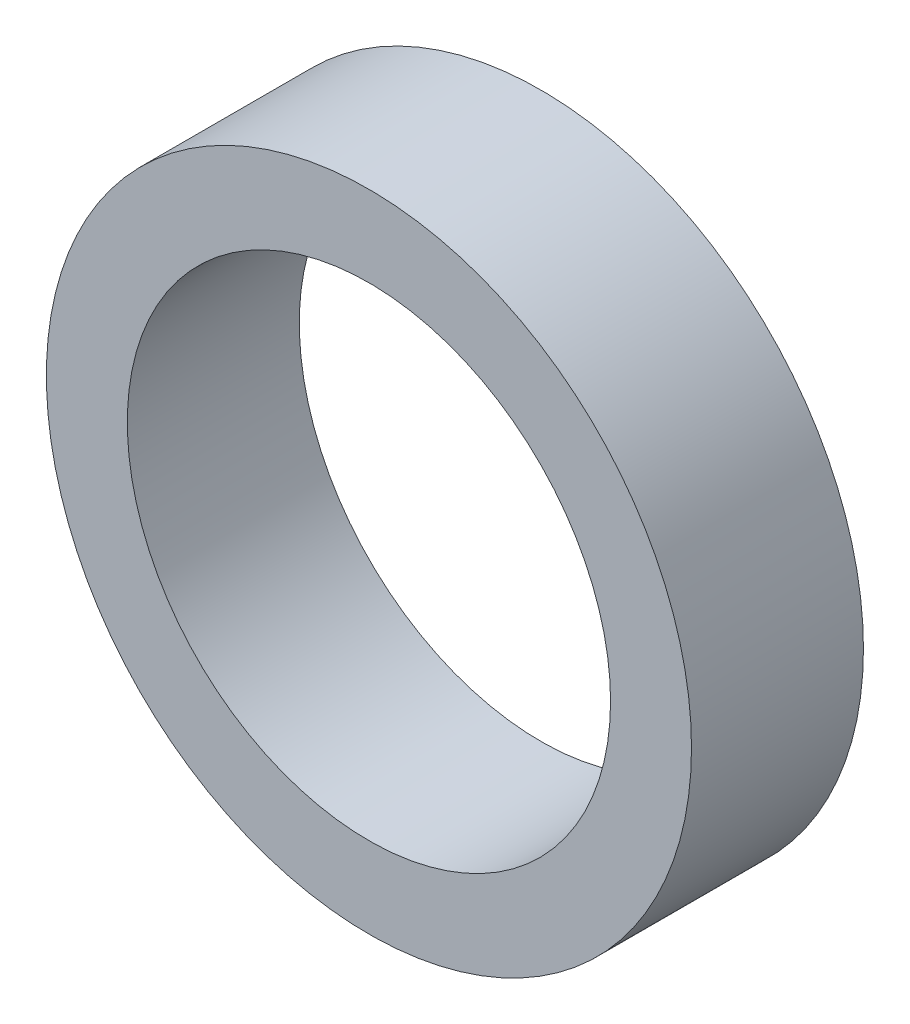
ISO-10303-21;
HEADER;
FILE_DESCRIPTION(('STEP AP214'),'2;1');
FILE_NAME('part.step','',(''),(''),'','','');
FILE_SCHEMA(('AUTOMOTIVE_DESIGN { 1 0 10303 214 1 1 1 1 }'));
ENDSEC;
DATA;
#1=APPLICATION_CONTEXT('core data for automotive mechanical design processes');
#2=APPLICATION_PROTOCOL_DEFINITION('international standard','automotive_design',2000,#1);
#3=PRODUCT_CONTEXT('',#1,'mechanical');
#4=PRODUCT('Part','Part','',(#3));
#5=PRODUCT_RELATED_PRODUCT_CATEGORY('part','',(#4));
#6=PRODUCT_DEFINITION_FORMATION('','',#4);
#7=PRODUCT_DEFINITION_CONTEXT('part definition',#1,'design');
#8=PRODUCT_DEFINITION('design','',#6,#7);
#9=PRODUCT_DEFINITION_SHAPE('','',#8);
#10=(LENGTH_UNIT() NAMED_UNIT(*) SI_UNIT(.MILLI.,.METRE.));
#11=(NAMED_UNIT(*) PLANE_ANGLE_UNIT() SI_UNIT($,.RADIAN.));
#12=(NAMED_UNIT(*) SI_UNIT($,.STERADIAN.) SOLID_ANGLE_UNIT());
#13=UNCERTAINTY_MEASURE_WITH_UNIT(LENGTH_MEASURE(1.E-05),#10,'distance_accuracy_value','');
#14=(GEOMETRIC_REPRESENTATION_CONTEXT(3) GLOBAL_UNCERTAINTY_ASSIGNED_CONTEXT((#13)) GLOBAL_UNIT_ASSIGNED_CONTEXT((#10,
#11,#12)) REPRESENTATION_CONTEXT('',''));
#15=CARTESIAN_POINT('',(0.,0.,0.));
#16=DIRECTION('',(0.,0.,1.));
#17=DIRECTION('',(1.,0.,0.));
#18=AXIS2_PLACEMENT_3D('',#15,#16,#17);
#19=CARTESIAN_POINT('',(0.,0.,20.));
#20=DIRECTION('',(0.,0.,1.));
#21=DIRECTION('',(1.,0.,0.));
#22=AXIS2_PLACEMENT_3D('',#19,#20,#21);
#23=PLANE('',#22);
#24=CARTESIAN_POINT('',(0.,0.,20.));
#25=DIRECTION('',(0.,0.,1.));
#26=DIRECTION('',(1.,0.,0.));
#27=AXIS2_PLACEMENT_3D('',#24,#25,#26);
#28=CIRCLE('',#27,37.5214285714286);
#29=CARTESIAN_POINT('',(37.5214285714286,0.,20.));
#30=VERTEX_POINT('',#29);
#31=EDGE_CURVE('E10',#30,#30,#28,.T.);
#32=ORIENTED_EDGE('',*,*,#31,.T.);
#33=EDGE_LOOP('',(#32));
#34=FACE_BOUND('',#33,.T.);
#35=CARTESIAN_POINT('',(0.,0.,20.));
#36=DIRECTION('',(0.,0.,1.));
#37=DIRECTION('',(1.,0.,0.));
#38=AXIS2_PLACEMENT_3D('',#35,#36,#37);
#39=CIRCLE('',#38,28.1055281417702);
#40=CARTESIAN_POINT('',(28.1055281417702,0.,20.));
#41=VERTEX_POINT('',#40);
#42=EDGE_CURVE('E42',#41,#41,#39,.T.);
#43=ORIENTED_EDGE('',*,*,#42,.F.);
#44=EDGE_LOOP('',(#43));
#45=FACE_BOUND('',#44,.T.);
#46=ADVANCED_FACE('F31',(#34,#45),#23,.T.);
#47=CARTESIAN_POINT('',(0.,0.,0.));
#48=DIRECTION('',(0.,0.,1.));
#49=DIRECTION('',(1.,0.,0.));
#50=AXIS2_PLACEMENT_3D('',#47,#48,#49);
#51=PLANE('',#50);
#52=CARTESIAN_POINT('',(0.,0.,0.));
#53=DIRECTION('',(0.,0.,1.));
#54=DIRECTION('',(1.,0.,0.));
#55=AXIS2_PLACEMENT_3D('',#52,#53,#54);
#56=CIRCLE('',#55,37.5214285714286);
#57=CARTESIAN_POINT('',(37.5214285714286,0.,0.));
#58=VERTEX_POINT('',#57);
#59=EDGE_CURVE('E35',#58,#58,#56,.T.);
#60=ORIENTED_EDGE('',*,*,#59,.F.);
#61=EDGE_LOOP('',(#60));
#62=FACE_BOUND('',#61,.T.);
#63=CARTESIAN_POINT('',(0.,0.,0.));
#64=DIRECTION('',(0.,0.,1.));
#65=DIRECTION('',(1.,0.,0.));
#66=AXIS2_PLACEMENT_3D('',#63,#64,#65);
#67=CIRCLE('',#66,28.1055281417702);
#68=CARTESIAN_POINT('',(28.1055281417702,0.,0.));
#69=VERTEX_POINT('',#68);
#70=EDGE_CURVE('E44',#69,#69,#67,.T.);
#71=ORIENTED_EDGE('',*,*,#70,.T.);
#72=EDGE_LOOP('',(#71));
#73=FACE_BOUND('',#72,.T.);
#74=ADVANCED_FACE('F54',(#62,#73),#51,.F.);
#75=CARTESIAN_POINT('',(0.,0.,20.));
#76=DIRECTION('',(0.,0.,-1.));
#77=DIRECTION('',(-1.,0.,0.));
#78=AXIS2_PLACEMENT_3D('',#75,#76,#77);
#79=CYLINDRICAL_SURFACE('',#78,37.5214285714286);
#80=ORIENTED_EDGE('',*,*,#31,.F.);
#81=EDGE_LOOP('',(#80));
#82=FACE_BOUND('',#81,.T.);
#83=ORIENTED_EDGE('',*,*,#59,.T.);
#84=EDGE_LOOP('',(#83));
#85=FACE_BOUND('',#84,.T.);
#86=ADVANCED_FACE('F33',(#82,#85),#79,.T.);
#87=CARTESIAN_POINT('',(0.,0.,20.));
#88=DIRECTION('',(0.,0.,-1.));
#89=DIRECTION('',(-1.,0.,0.));
#90=AXIS2_PLACEMENT_3D('',#87,#88,#89);
#91=CYLINDRICAL_SURFACE('',#90,28.1055281417702);
#92=ORIENTED_EDGE('',*,*,#42,.T.);
#93=EDGE_LOOP('',(#92));
#94=FACE_BOUND('',#93,.T.);
#95=ORIENTED_EDGE('',*,*,#70,.F.);
#96=EDGE_LOOP('',(#95));
#97=FACE_BOUND('',#96,.T.);
#98=ADVANCED_FACE('F50',(#94,#97),#91,.F.);
#99=CLOSED_SHELL('',(#46,#74,#86,#98));
#100=MANIFOLD_SOLID_BREP('B2',#99);
#101=ADVANCED_BREP_SHAPE_REPRESENTATION('',(#18,#100),#14);
#102=SHAPE_DEFINITION_REPRESENTATION(#9,#101);
ENDSEC;
END-ISO-10303-21;
